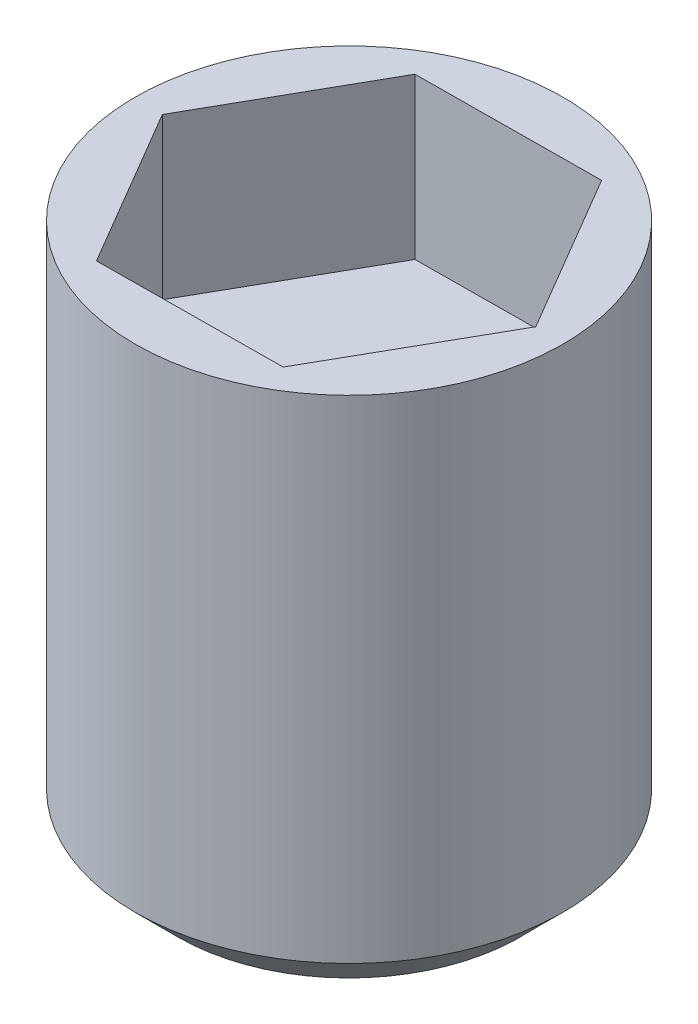
ISO-10303-21;
HEADER;
FILE_DESCRIPTION(('STEP AP214'),'2;1');
FILE_NAME('part.step','',(''),(''),'','','');
FILE_SCHEMA(('AUTOMOTIVE_DESIGN { 1 0 10303 214 1 1 1 1 }'));
ENDSEC;
DATA;
#1=APPLICATION_CONTEXT('core data for automotive mechanical design processes');
#2=APPLICATION_PROTOCOL_DEFINITION('international standard','automotive_design',2000,#1);
#3=PRODUCT_CONTEXT('',#1,'mechanical');
#4=PRODUCT('Part','Part','',(#3));
#5=PRODUCT_RELATED_PRODUCT_CATEGORY('part','',(#4));
#6=PRODUCT_DEFINITION_FORMATION('','',#4);
#7=PRODUCT_DEFINITION_CONTEXT('part definition',#1,'design');
#8=PRODUCT_DEFINITION('design','',#6,#7);
#9=PRODUCT_DEFINITION_SHAPE('','',#8);
#10=(LENGTH_UNIT() NAMED_UNIT(*) SI_UNIT(.MILLI.,.METRE.));
#11=(NAMED_UNIT(*) PLANE_ANGLE_UNIT() SI_UNIT($,.RADIAN.));
#12=(NAMED_UNIT(*) SI_UNIT($,.STERADIAN.) SOLID_ANGLE_UNIT());
#13=UNCERTAINTY_MEASURE_WITH_UNIT(LENGTH_MEASURE(1.E-05),#10,'distance_accuracy_value','');
#14=(GEOMETRIC_REPRESENTATION_CONTEXT(3) GLOBAL_UNCERTAINTY_ASSIGNED_CONTEXT((#13)) GLOBAL_UNIT_ASSIGNED_CONTEXT((#10,
#11,#12)) REPRESENTATION_CONTEXT('',''));
#15=CARTESIAN_POINT('',(0.,0.,0.));
#16=DIRECTION('',(0.,0.,1.));
#17=DIRECTION('',(1.,0.,0.));
#18=AXIS2_PLACEMENT_3D('',#15,#16,#17);
#19=CARTESIAN_POINT('',(0.,0.,0.));
#20=DIRECTION('',(0.,1.,0.));
#21=DIRECTION('',(0.,0.,1.));
#22=AXIS2_PLACEMENT_3D('',#19,#20,#21);
#23=PLANE('',#22);
#24=CARTESIAN_POINT('',(0.,0.,0.));
#25=DIRECTION('',(0.,1.,0.));
#26=DIRECTION('',(0.,0.,1.));
#27=AXIS2_PLACEMENT_3D('',#24,#25,#26);
#28=CIRCLE('',#27,3.2);
#29=CARTESIAN_POINT('',(0.,0.,3.2));
#30=VERTEX_POINT('',#29);
#31=EDGE_CURVE('E11',#30,#30,#28,.T.);
#32=ORIENTED_EDGE('',*,*,#31,.F.);
#33=EDGE_LOOP('',(#32));
#34=FACE_BOUND('',#33,.T.);
#35=ADVANCED_FACE('F34',(#34),#23,.F.);
#36=CARTESIAN_POINT('',(0.,0.,0.));
#37=DIRECTION('',(0.,1.,0.));
#38=DIRECTION('',(0.,0.,1.));
#39=AXIS2_PLACEMENT_3D('',#36,#37,#38);
#40=CONICAL_SURFACE('',#39,3.2,0.785398163397451);
#41=CARTESIAN_POINT('',(0.,0.799999999999995,0.));
#42=DIRECTION('',(0.,1.,0.));
#43=DIRECTION('',(0.,0.,1.));
#44=AXIS2_PLACEMENT_3D('',#41,#42,#43);
#45=CIRCLE('',#44,4.);
#46=CARTESIAN_POINT('',(0.,0.799999999999995,4.));
#47=VERTEX_POINT('',#46);
#48=EDGE_CURVE('E41',#47,#47,#45,.T.);
#49=ORIENTED_EDGE('',*,*,#48,.F.);
#50=EDGE_LOOP('',(#49));
#51=FACE_BOUND('',#50,.T.);
#52=ORIENTED_EDGE('',*,*,#31,.T.);
#53=EDGE_LOOP('',(#52));
#54=FACE_BOUND('',#53,.T.);
#55=ADVANCED_FACE('F147',(#51,#54),#40,.T.);
#56=CARTESIAN_POINT('',(0.,68.6445759886598,0.));
#57=DIRECTION('',(0.,1.,0.));
#58=DIRECTION('',(0.,0.,1.));
#59=AXIS2_PLACEMENT_3D('',#56,#57,#58);
#60=CYLINDRICAL_SURFACE('',#59,4.);
#61=CARTESIAN_POINT('',(0.,10.,0.));
#62=DIRECTION('',(0.,1.,0.));
#63=DIRECTION('',(0.,0.,1.));
#64=AXIS2_PLACEMENT_3D('',#61,#62,#63);
#65=CIRCLE('',#64,4.);
#66=CARTESIAN_POINT('',(0.,10.,4.));
#67=VERTEX_POINT('',#66);
#68=EDGE_CURVE('E135',#67,#67,#65,.T.);
#69=ORIENTED_EDGE('',*,*,#68,.F.);
#70=EDGE_LOOP('',(#69));
#71=FACE_BOUND('',#70,.T.);
#72=ORIENTED_EDGE('',*,*,#48,.T.);
#73=EDGE_LOOP('',(#72));
#74=FACE_BOUND('',#73,.T.);
#75=ADVANCED_FACE('F145',(#71,#74),#60,.T.);
#76=CARTESIAN_POINT('',(4.,10.,0.));
#77=DIRECTION('',(0.,-1.,0.));
#78=DIRECTION('',(0.,0.,-1.));
#79=AXIS2_PLACEMENT_3D('',#76,#77,#78);
#80=PLANE('',#79);
#81=DIRECTION('',(0.493268448593922,0.,-0.869877139383341));
#82=VECTOR('',#81,1.);
#83=CARTESIAN_POINT('',(1.75526540341467,10.,2.98647674753639));
#84=LINE('',#83,#82);
#85=CARTESIAN_POINT('',(1.75526540341467,10.,2.98647674753639));
#86=VERTEX_POINT('',#85);
#87=CARTESIAN_POINT('',(3.46399743288537,10.,-0.0268660559728551));
#88=VERTEX_POINT('',#87);
#89=EDGE_CURVE('E122',#86,#88,#84,.T.);
#90=ORIENTED_EDGE('',*,*,#89,.F.);
#91=DIRECTION('',(0.999969925174272,0.,-0.00775556232399564));
#92=VECTOR('',#91,1.);
#93=CARTESIAN_POINT('',(-1.7087320294707,10.,3.01334280350924));
#94=LINE('',#93,#92);
#95=CARTESIAN_POINT('',(-1.7087320294707,10.,3.01334280350924));
#96=VERTEX_POINT('',#95);
#97=EDGE_CURVE('E48',#96,#86,#94,.T.);
#98=ORIENTED_EDGE('',*,*,#97,.F.);
#99=DIRECTION('',(0.506701476580349,0.,0.862121577059346));
#100=VECTOR('',#99,1.);
#101=CARTESIAN_POINT('',(-3.46399743288537,10.,0.0268660559728533));
#102=LINE('',#101,#100);
#103=CARTESIAN_POINT('',(-3.46399743288537,10.,0.0268660559728533));
#104=VERTEX_POINT('',#103);
#105=EDGE_CURVE('E131',#104,#96,#102,.T.);
#106=ORIENTED_EDGE('',*,*,#105,.F.);
#107=DIRECTION('',(-0.493268448593922,0.,0.869877139383341));
#108=VECTOR('',#107,1.);
#109=CARTESIAN_POINT('',(-1.75526540341467,10.,-2.98647674753639));
#110=LINE('',#109,#108);
#111=CARTESIAN_POINT('',(-1.75526540341467,10.,-2.98647674753639));
#112=VERTEX_POINT('',#111);
#113=EDGE_CURVE('E129',#112,#104,#110,.T.);
#114=ORIENTED_EDGE('',*,*,#113,.F.);
#115=DIRECTION('',(-0.999969925174272,0.,0.0077555623239955));
#116=VECTOR('',#115,1.);
#117=CARTESIAN_POINT('',(1.7087320294707,10.,-3.01334280350924));
#118=LINE('',#117,#116);
#119=CARTESIAN_POINT('',(1.7087320294707,10.,-3.01334280350924));
#120=VERTEX_POINT('',#119);
#121=EDGE_CURVE('E96',#120,#112,#118,.T.);
#122=ORIENTED_EDGE('',*,*,#121,.F.);
#123=DIRECTION('',(-0.506701476580349,0.,-0.862121577059346));
#124=VECTOR('',#123,1.);
#125=CARTESIAN_POINT('',(3.46399743288537,10.,-0.0268660559728551));
#126=LINE('',#125,#124);
#127=EDGE_CURVE('E125',#88,#120,#126,.T.);
#128=ORIENTED_EDGE('',*,*,#127,.F.);
#129=EDGE_LOOP('',(#90,#98,#106,#114,#122,#128));
#130=FACE_BOUND('',#129,.T.);
#131=ORIENTED_EDGE('',*,*,#68,.T.);
#132=EDGE_LOOP('',(#131));
#133=FACE_BOUND('',#132,.T.);
#134=ADVANCED_FACE('F165',(#130,#133),#80,.F.);
#135=CARTESIAN_POINT('',(-1.7087320294707,7.,3.01334280350924));
#136=DIRECTION('',(0.00775556232399564,0.,0.999969925174272));
#137=DIRECTION('',(0.999969925174272,0.,-0.00775556232399564));
#138=AXIS2_PLACEMENT_3D('',#135,#136,#137);
#139=PLANE('',#138);
#140=ORIENTED_EDGE('',*,*,#97,.T.);
#141=DIRECTION('',(0.,1.,0.));
#142=VECTOR('',#141,1.);
#143=CARTESIAN_POINT('',(1.75526540341467,7.,2.98647674753639));
#144=LINE('',#143,#142);
#145=CARTESIAN_POINT('',(1.75526540341467,7.,2.98647674753639));
#146=VERTEX_POINT('',#145);
#147=EDGE_CURVE('E78',#146,#86,#144,.T.);
#148=ORIENTED_EDGE('',*,*,#147,.F.);
#149=DIRECTION('',(0.999969925174272,0.,-0.00775556232399564));
#150=VECTOR('',#149,1.);
#151=CARTESIAN_POINT('',(-1.7087320294707,7.,3.01334280350924));
#152=LINE('',#151,#150);
#153=CARTESIAN_POINT('',(-1.7087320294707,7.,3.01334280350924));
#154=VERTEX_POINT('',#153);
#155=EDGE_CURVE('E133',#154,#146,#152,.T.);
#156=ORIENTED_EDGE('',*,*,#155,.F.);
#157=DIRECTION('',(0.,1.,0.));
#158=VECTOR('',#157,1.);
#159=CARTESIAN_POINT('',(-1.7087320294707,7.,3.01334280350924));
#160=LINE('',#159,#158);
#161=EDGE_CURVE('E56',#154,#96,#160,.T.);
#162=ORIENTED_EDGE('',*,*,#161,.T.);
#163=EDGE_LOOP('',(#140,#148,#156,#162));
#164=FACE_BOUND('',#163,.T.);
#165=ADVANCED_FACE('F173',(#164),#139,.F.);
#166=CARTESIAN_POINT('',(-3.46399743288537,7.,0.0268660559728533));
#167=DIRECTION('',(-0.862121577059346,0.,0.506701476580349));
#168=DIRECTION('',(0.506701476580349,0.,0.862121577059346));
#169=AXIS2_PLACEMENT_3D('',#166,#167,#168);
#170=PLANE('',#169);
#171=ORIENTED_EDGE('',*,*,#105,.T.);
#172=ORIENTED_EDGE('',*,*,#161,.F.);
#173=DIRECTION('',(0.506701476580349,0.,0.862121577059346));
#174=VECTOR('',#173,1.);
#175=CARTESIAN_POINT('',(-3.46399743288537,7.,0.0268660559728533));
#176=LINE('',#175,#174);
#177=CARTESIAN_POINT('',(-3.46399743288537,7.,0.0268660559728533));
#178=VERTEX_POINT('',#177);
#179=EDGE_CURVE('E108',#178,#154,#176,.T.);
#180=ORIENTED_EDGE('',*,*,#179,.F.);
#181=DIRECTION('',(0.,1.,0.));
#182=VECTOR('',#181,1.);
#183=CARTESIAN_POINT('',(-3.46399743288537,7.,0.0268660559728533));
#184=LINE('',#183,#182);
#185=EDGE_CURVE('E100',#178,#104,#184,.T.);
#186=ORIENTED_EDGE('',*,*,#185,.T.);
#187=EDGE_LOOP('',(#171,#172,#180,#186));
#188=FACE_BOUND('',#187,.T.);
#189=ADVANCED_FACE('F181',(#188),#170,.F.);
#190=CARTESIAN_POINT('',(-1.75526540341467,7.,-2.98647674753639));
#191=DIRECTION('',(-0.869877139383341,0.,-0.493268448593922));
#192=DIRECTION('',(-0.493268448593922,0.,0.869877139383342));
#193=AXIS2_PLACEMENT_3D('',#190,#191,#192);
#194=PLANE('',#193);
#195=ORIENTED_EDGE('',*,*,#113,.T.);
#196=ORIENTED_EDGE('',*,*,#185,.F.);
#197=DIRECTION('',(-0.493268448593922,0.,0.869877139383341));
#198=VECTOR('',#197,1.);
#199=CARTESIAN_POINT('',(-1.75526540341467,7.,-2.98647674753639));
#200=LINE('',#199,#198);
#201=CARTESIAN_POINT('',(-1.75526540341467,7.,-2.98647674753639));
#202=VERTEX_POINT('',#201);
#203=EDGE_CURVE('E104',#202,#178,#200,.T.);
#204=ORIENTED_EDGE('',*,*,#203,.F.);
#205=DIRECTION('',(0.,1.,0.));
#206=VECTOR('',#205,1.);
#207=CARTESIAN_POINT('',(-1.75526540341467,7.,-2.98647674753639));
#208=LINE('',#207,#206);
#209=EDGE_CURVE('E89',#202,#112,#208,.T.);
#210=ORIENTED_EDGE('',*,*,#209,.T.);
#211=EDGE_LOOP('',(#195,#196,#204,#210));
#212=FACE_BOUND('',#211,.T.);
#213=ADVANCED_FACE('F105',(#212),#194,.F.);
#214=CARTESIAN_POINT('',(1.7087320294707,7.,-3.01334280350924));
#215=DIRECTION('',(-0.00775556232399551,0.,-0.999969925174272));
#216=DIRECTION('',(-0.999969925174272,0.,0.00775556232399551));
#217=AXIS2_PLACEMENT_3D('',#214,#215,#216);
#218=PLANE('',#217);
#219=ORIENTED_EDGE('',*,*,#121,.T.);
#220=ORIENTED_EDGE('',*,*,#209,.F.);
#221=DIRECTION('',(-0.999969925174272,0.,0.0077555623239955));
#222=VECTOR('',#221,1.);
#223=CARTESIAN_POINT('',(1.7087320294707,7.,-3.01334280350924));
#224=LINE('',#223,#222);
#225=CARTESIAN_POINT('',(1.7087320294707,7.,-3.01334280350924));
#226=VERTEX_POINT('',#225);
#227=EDGE_CURVE('E93',#226,#202,#224,.T.);
#228=ORIENTED_EDGE('',*,*,#227,.F.);
#229=DIRECTION('',(0.,1.,0.));
#230=VECTOR('',#229,1.);
#231=CARTESIAN_POINT('',(1.7087320294707,7.,-3.01334280350924));
#232=LINE('',#231,#230);
#233=EDGE_CURVE('E101',#226,#120,#232,.T.);
#234=ORIENTED_EDGE('',*,*,#233,.T.);
#235=EDGE_LOOP('',(#219,#220,#228,#234));
#236=FACE_BOUND('',#235,.T.);
#237=ADVANCED_FACE('F91',(#236),#218,.F.);
#238=CARTESIAN_POINT('',(3.46399743288537,7.,-0.0268660559728551));
#239=DIRECTION('',(0.862121577059346,0.,-0.50670147658035));
#240=DIRECTION('',(-0.50670147658035,0.,-0.862121577059346));
#241=AXIS2_PLACEMENT_3D('',#238,#239,#240);
#242=PLANE('',#241);
#243=ORIENTED_EDGE('',*,*,#127,.T.);
#244=ORIENTED_EDGE('',*,*,#233,.F.);
#245=DIRECTION('',(-0.506701476580349,0.,-0.862121577059346));
#246=VECTOR('',#245,1.);
#247=CARTESIAN_POINT('',(3.46399743288537,7.,-0.0268660559728551));
#248=LINE('',#247,#246);
#249=CARTESIAN_POINT('',(3.46399743288537,7.,-0.0268660559728551));
#250=VERTEX_POINT('',#249);
#251=EDGE_CURVE('E114',#250,#226,#248,.T.);
#252=ORIENTED_EDGE('',*,*,#251,.F.);
#253=DIRECTION('',(0.,1.,0.));
#254=VECTOR('',#253,1.);
#255=CARTESIAN_POINT('',(3.46399743288537,7.,-0.0268660559728551));
#256=LINE('',#255,#254);
#257=EDGE_CURVE('E138',#250,#88,#256,.T.);
#258=ORIENTED_EDGE('',*,*,#257,.T.);
#259=EDGE_LOOP('',(#243,#244,#252,#258));
#260=FACE_BOUND('',#259,.T.);
#261=ADVANCED_FACE('F200',(#260),#242,.F.);
#262=CARTESIAN_POINT('',(1.75526540341467,7.,2.98647674753639));
#263=DIRECTION('',(0.869877139383341,0.,0.493268448593922));
#264=DIRECTION('',(0.493268448593922,0.,-0.869877139383342));
#265=AXIS2_PLACEMENT_3D('',#262,#263,#264);
#266=PLANE('',#265);
#267=ORIENTED_EDGE('',*,*,#89,.T.);
#268=ORIENTED_EDGE('',*,*,#257,.F.);
#269=DIRECTION('',(0.493268448593922,0.,-0.869877139383341));
#270=VECTOR('',#269,1.);
#271=CARTESIAN_POINT('',(1.75526540341467,7.,2.98647674753639));
#272=LINE('',#271,#270);
#273=EDGE_CURVE('E116',#146,#250,#272,.T.);
#274=ORIENTED_EDGE('',*,*,#273,.F.);
#275=ORIENTED_EDGE('',*,*,#147,.T.);
#276=EDGE_LOOP('',(#267,#268,#274,#275));
#277=FACE_BOUND('',#276,.T.);
#278=ADVANCED_FACE('F207',(#277),#266,.F.);
#279=CARTESIAN_POINT('',(0.,7.,0.));
#280=DIRECTION('',(0.,1.,0.));
#281=DIRECTION('',(0.,0.,1.));
#282=AXIS2_PLACEMENT_3D('',#279,#280,#281);
#283=PLANE('',#282);
#284=ORIENTED_EDGE('',*,*,#155,.T.);
#285=ORIENTED_EDGE('',*,*,#273,.T.);
#286=ORIENTED_EDGE('',*,*,#251,.T.);
#287=ORIENTED_EDGE('',*,*,#227,.T.);
#288=ORIENTED_EDGE('',*,*,#203,.T.);
#289=ORIENTED_EDGE('',*,*,#179,.T.);
#290=EDGE_LOOP('',(#284,#285,#286,#287,#288,#289));
#291=FACE_BOUND('',#290,.T.);
#292=ADVANCED_FACE('F111',(#291),#283,.T.);
#293=CLOSED_SHELL('',(#35,#55,#75,#134,#165,#189,#213,#237,#261,#278,#292));
#294=MANIFOLD_SOLID_BREP('B2',#293);
#295=ADVANCED_BREP_SHAPE_REPRESENTATION('',(#18,#294),#14);
#296=SHAPE_DEFINITION_REPRESENTATION(#9,#295);
ENDSEC;
END-ISO-10303-21;
